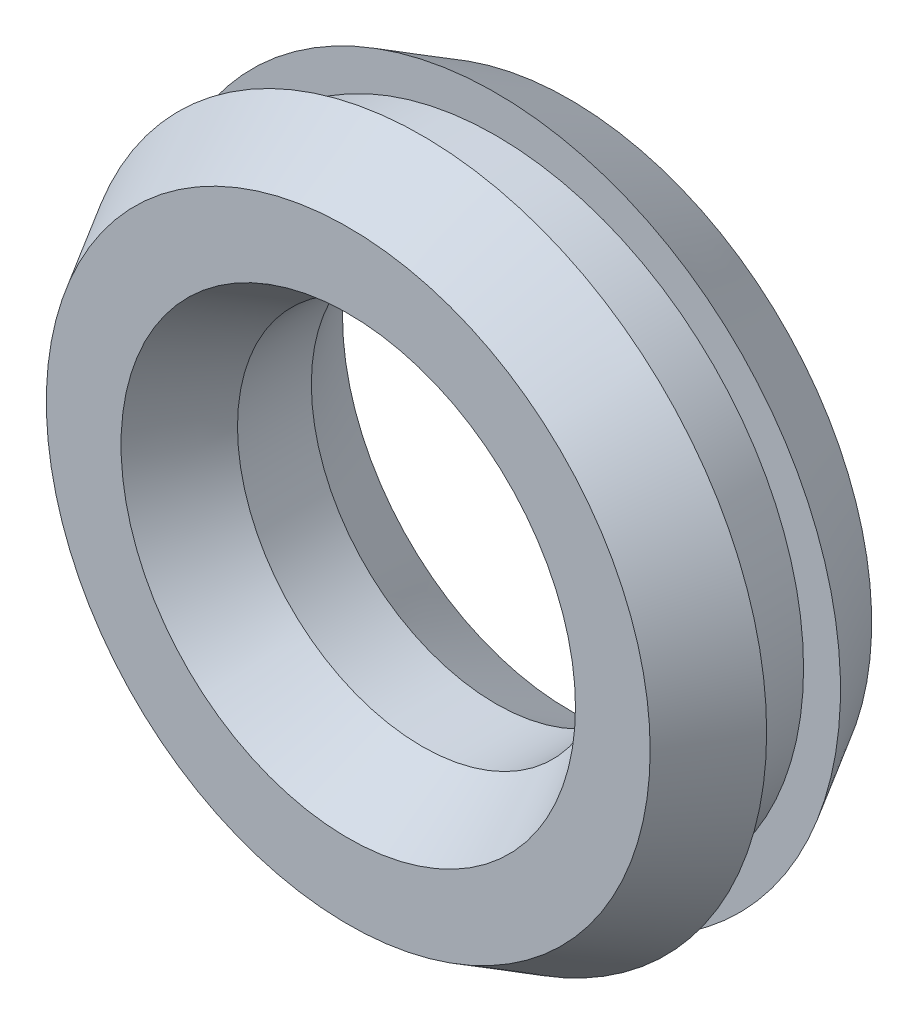
ISO-10303-21;
HEADER;
FILE_DESCRIPTION(('STEP AP214'),'2;1');
FILE_NAME('part.step','',(''),(''),'','','');
FILE_SCHEMA(('AUTOMOTIVE_DESIGN { 1 0 10303 214 1 1 1 1 }'));
ENDSEC;
DATA;
#1=APPLICATION_CONTEXT('core data for automotive mechanical design processes');
#2=APPLICATION_PROTOCOL_DEFINITION('international standard','automotive_design',2000,#1);
#3=PRODUCT_CONTEXT('',#1,'mechanical');
#4=PRODUCT('Part','Part','',(#3));
#5=PRODUCT_RELATED_PRODUCT_CATEGORY('part','',(#4));
#6=PRODUCT_DEFINITION_FORMATION('','',#4);
#7=PRODUCT_DEFINITION_CONTEXT('part definition',#1,'design');
#8=PRODUCT_DEFINITION('design','',#6,#7);
#9=PRODUCT_DEFINITION_SHAPE('','',#8);
#10=(LENGTH_UNIT() NAMED_UNIT(*) SI_UNIT(.MILLI.,.METRE.));
#11=(NAMED_UNIT(*) PLANE_ANGLE_UNIT() SI_UNIT($,.RADIAN.));
#12=(NAMED_UNIT(*) SI_UNIT($,.STERADIAN.) SOLID_ANGLE_UNIT());
#13=UNCERTAINTY_MEASURE_WITH_UNIT(LENGTH_MEASURE(1.E-05),#10,'distance_accuracy_value','');
#14=(GEOMETRIC_REPRESENTATION_CONTEXT(3) GLOBAL_UNCERTAINTY_ASSIGNED_CONTEXT((#13)) GLOBAL_UNIT_ASSIGNED_CONTEXT((#10,
#11,#12)) REPRESENTATION_CONTEXT('',''));
#15=CARTESIAN_POINT('',(0.,0.,0.));
#16=DIRECTION('',(0.,0.,1.));
#17=DIRECTION('',(1.,0.,0.));
#18=AXIS2_PLACEMENT_3D('',#15,#16,#17);
#19=CARTESIAN_POINT('',(0.,0.,3.));
#20=DIRECTION('',(0.,0.,-1.));
#21=DIRECTION('',(-1.,0.,0.));
#22=AXIS2_PLACEMENT_3D('',#19,#20,#21);
#23=CYLINDRICAL_SURFACE('',#22,12.5);
#24=CARTESIAN_POINT('',(0.,0.,3.));
#25=DIRECTION('',(0.,0.,1.));
#26=DIRECTION('',(1.,0.,0.));
#27=AXIS2_PLACEMENT_3D('',#24,#25,#26);
#28=CIRCLE('',#27,12.5);
#29=CARTESIAN_POINT('',(12.5,0.,3.));
#30=VERTEX_POINT('',#29);
#31=EDGE_CURVE('E10',#30,#30,#28,.T.);
#32=ORIENTED_EDGE('',*,*,#31,.F.);
#33=EDGE_LOOP('',(#32));
#34=FACE_BOUND('',#33,.T.);
#35=CARTESIAN_POINT('',(0.,0.,0.));
#36=DIRECTION('',(0.,0.,1.));
#37=DIRECTION('',(1.,0.,0.));
#38=AXIS2_PLACEMENT_3D('',#35,#36,#37);
#39=CIRCLE('',#38,12.5);
#40=CARTESIAN_POINT('',(12.5,0.,0.));
#41=VERTEX_POINT('',#40);
#42=EDGE_CURVE('E39',#41,#41,#39,.T.);
#43=ORIENTED_EDGE('',*,*,#42,.T.);
#44=EDGE_LOOP('',(#43));
#45=FACE_BOUND('',#44,.T.);
#46=ADVANCED_FACE('F36',(#34,#45),#23,.T.);
#47=CARTESIAN_POINT('',(0.,0.,3.));
#48=DIRECTION('',(0.,0.,-1.));
#49=DIRECTION('',(-1.,0.,0.));
#50=AXIS2_PLACEMENT_3D('',#47,#48,#49);
#51=CYLINDRICAL_SURFACE('',#50,7.5);
#52=CARTESIAN_POINT('',(0.,0.,3.));
#53=DIRECTION('',(0.,0.,1.));
#54=DIRECTION('',(1.,0.,0.));
#55=AXIS2_PLACEMENT_3D('',#52,#53,#54);
#56=CIRCLE('',#55,7.5);
#57=CARTESIAN_POINT('',(7.5,0.,3.));
#58=VERTEX_POINT('',#57);
#59=EDGE_CURVE('E57',#58,#58,#56,.T.);
#60=ORIENTED_EDGE('',*,*,#59,.T.);
#61=EDGE_LOOP('',(#60));
#62=FACE_BOUND('',#61,.T.);
#63=CARTESIAN_POINT('',(0.,0.,0.));
#64=DIRECTION('',(0.,0.,1.));
#65=DIRECTION('',(1.,0.,0.));
#66=AXIS2_PLACEMENT_3D('',#63,#64,#65);
#67=CIRCLE('',#66,7.5);
#68=CARTESIAN_POINT('',(7.5,0.,0.));
#69=VERTEX_POINT('',#68);
#70=EDGE_CURVE('E44',#69,#69,#67,.T.);
#71=ORIENTED_EDGE('',*,*,#70,.F.);
#72=EDGE_LOOP('',(#71));
#73=FACE_BOUND('',#72,.T.);
#74=ADVANCED_FACE('F99',(#62,#73),#51,.F.);
#75=CARTESIAN_POINT('',(0.,0.,6.));
#76=DIRECTION('',(0.,0.,1.));
#77=DIRECTION('',(1.,0.,0.));
#78=AXIS2_PLACEMENT_3D('',#75,#76,#77);
#79=PLANE('',#78);
#80=CARTESIAN_POINT('',(0.,0.,6.));
#81=DIRECTION('',(0.,0.,1.));
#82=DIRECTION('',(1.,0.,0.));
#83=AXIS2_PLACEMENT_3D('',#80,#81,#82);
#84=CIRCLE('',#83,12.2679491924311);
#85=CARTESIAN_POINT('',(12.2679491924311,0.,6.));
#86=VERTEX_POINT('',#85);
#87=EDGE_CURVE('E49',#86,#86,#84,.T.);
#88=ORIENTED_EDGE('',*,*,#87,.T.);
#89=EDGE_LOOP('',(#88));
#90=FACE_BOUND('',#89,.T.);
#91=CARTESIAN_POINT('',(0.,0.,6.));
#92=DIRECTION('',(0.,0.,1.));
#93=DIRECTION('',(1.,0.,0.));
#94=AXIS2_PLACEMENT_3D('',#91,#92,#93);
#95=CIRCLE('',#94,9.23205080756888);
#96=CARTESIAN_POINT('',(9.23205080756888,0.,6.));
#97=VERTEX_POINT('',#96);
#98=EDGE_CURVE('E52',#97,#97,#95,.T.);
#99=ORIENTED_EDGE('',*,*,#98,.F.);
#100=EDGE_LOOP('',(#99));
#101=FACE_BOUND('',#100,.T.);
#102=ADVANCED_FACE('F104',(#90,#101),#79,.T.);
#103=CARTESIAN_POINT('',(0.,0.,3.));
#104=DIRECTION('',(0.,0.,1.));
#105=DIRECTION('',(1.,0.,0.));
#106=AXIS2_PLACEMENT_3D('',#103,#104,#105);
#107=PLANE('',#106);
#108=ORIENTED_EDGE('',*,*,#31,.T.);
#109=EDGE_LOOP('',(#108));
#110=FACE_BOUND('',#109,.T.);
#111=CARTESIAN_POINT('',(0.,0.,3.));
#112=DIRECTION('',(0.,0.,1.));
#113=DIRECTION('',(1.,0.,0.));
#114=AXIS2_PLACEMENT_3D('',#111,#112,#113);
#115=CIRCLE('',#114,14.);
#116=CARTESIAN_POINT('',(14.,0.,3.));
#117=VERTEX_POINT('',#116);
#118=EDGE_CURVE('E56',#117,#117,#115,.T.);
#119=ORIENTED_EDGE('',*,*,#118,.F.);
#120=EDGE_LOOP('',(#119));
#121=FACE_BOUND('',#120,.T.);
#122=ADVANCED_FACE('F112',(#110,#121),#107,.F.);
#123=CARTESIAN_POINT('',(0.,0.,3.));
#124=DIRECTION('',(0.,0.,-1.));
#125=DIRECTION('',(1.,0.,0.));
#126=AXIS2_PLACEMENT_3D('',#123,#124,#125);
#127=CONICAL_SURFACE('',#126,14.,0.5235987755983);
#128=ORIENTED_EDGE('',*,*,#87,.F.);
#129=EDGE_LOOP('',(#128));
#130=FACE_BOUND('',#129,.T.);
#131=ORIENTED_EDGE('',*,*,#118,.T.);
#132=EDGE_LOOP('',(#131));
#133=FACE_BOUND('',#132,.T.);
#134=ADVANCED_FACE('F119',(#130,#133),#127,.T.);
#135=CARTESIAN_POINT('',(0.,0.,3.));
#136=DIRECTION('',(0.,0.,1.));
#137=DIRECTION('',(1.,0.,0.));
#138=AXIS2_PLACEMENT_3D('',#135,#136,#137);
#139=CONICAL_SURFACE('',#138,7.5,0.5235987755983);
#140=ORIENTED_EDGE('',*,*,#98,.T.);
#141=EDGE_LOOP('',(#140));
#142=FACE_BOUND('',#141,.T.);
#143=ORIENTED_EDGE('',*,*,#59,.F.);
#144=EDGE_LOOP('',(#143));
#145=FACE_BOUND('',#144,.T.);
#146=ADVANCED_FACE('F94',(#142,#145),#139,.F.);
#147=CARTESIAN_POINT('',(0.,0.,-3.));
#148=DIRECTION('',(0.,0.,-1.));
#149=DIRECTION('',(-1.,0.,0.));
#150=AXIS2_PLACEMENT_3D('',#147,#148,#149);
#151=PLANE('',#150);
#152=CARTESIAN_POINT('',(0.,0.,-3.));
#153=DIRECTION('',(0.,0.,-1.));
#154=DIRECTION('',(-1.,0.,0.));
#155=AXIS2_PLACEMENT_3D('',#152,#153,#154);
#156=CIRCLE('',#155,12.2679491924311);
#157=CARTESIAN_POINT('',(-12.2679491924311,0.,-3.));
#158=VERTEX_POINT('',#157);
#159=EDGE_CURVE('E72',#158,#158,#156,.T.);
#160=ORIENTED_EDGE('',*,*,#159,.T.);
#161=EDGE_LOOP('',(#160));
#162=FACE_BOUND('',#161,.T.);
#163=CARTESIAN_POINT('',(0.,0.,-3.));
#164=DIRECTION('',(0.,0.,-1.));
#165=DIRECTION('',(-1.,0.,0.));
#166=AXIS2_PLACEMENT_3D('',#163,#164,#165);
#167=CIRCLE('',#166,9.23205080756888);
#168=CARTESIAN_POINT('',(-9.23205080756888,0.,-3.));
#169=VERTEX_POINT('',#168);
#170=EDGE_CURVE('E67',#169,#169,#167,.T.);
#171=ORIENTED_EDGE('',*,*,#170,.F.);
#172=EDGE_LOOP('',(#171));
#173=FACE_BOUND('',#172,.T.);
#174=ADVANCED_FACE('F84',(#162,#173),#151,.T.);
#175=CARTESIAN_POINT('',(0.,0.,0.));
#176=DIRECTION('',(0.,0.,-1.));
#177=DIRECTION('',(-1.,0.,0.));
#178=AXIS2_PLACEMENT_3D('',#175,#176,#177);
#179=PLANE('',#178);
#180=ORIENTED_EDGE('',*,*,#42,.F.);
#181=EDGE_LOOP('',(#180));
#182=FACE_BOUND('',#181,.T.);
#183=CARTESIAN_POINT('',(0.,0.,0.));
#184=DIRECTION('',(0.,0.,-1.));
#185=DIRECTION('',(-1.,0.,0.));
#186=AXIS2_PLACEMENT_3D('',#183,#184,#185);
#187=CIRCLE('',#186,14.);
#188=CARTESIAN_POINT('',(-14.,0.,0.));
#189=VERTEX_POINT('',#188);
#190=EDGE_CURVE('E71',#189,#189,#187,.T.);
#191=ORIENTED_EDGE('',*,*,#190,.F.);
#192=EDGE_LOOP('',(#191));
#193=FACE_BOUND('',#192,.T.);
#194=ADVANCED_FACE('F82',(#182,#193),#179,.F.);
#195=CARTESIAN_POINT('',(0.,0.,0.));
#196=DIRECTION('',(0.,0.,1.));
#197=DIRECTION('',(-1.,0.,0.));
#198=AXIS2_PLACEMENT_3D('',#195,#196,#197);
#199=CONICAL_SURFACE('',#198,14.,0.5235987755983);
#200=ORIENTED_EDGE('',*,*,#159,.F.);
#201=EDGE_LOOP('',(#200));
#202=FACE_BOUND('',#201,.T.);
#203=ORIENTED_EDGE('',*,*,#190,.T.);
#204=EDGE_LOOP('',(#203));
#205=FACE_BOUND('',#204,.T.);
#206=ADVANCED_FACE('F80',(#202,#205),#199,.T.);
#207=CARTESIAN_POINT('',(0.,0.,0.));
#208=DIRECTION('',(0.,0.,-1.));
#209=DIRECTION('',(-1.,0.,0.));
#210=AXIS2_PLACEMENT_3D('',#207,#208,#209);
#211=CONICAL_SURFACE('',#210,7.5,0.5235987755983);
#212=ORIENTED_EDGE('',*,*,#170,.T.);
#213=EDGE_LOOP('',(#212));
#214=FACE_BOUND('',#213,.T.);
#215=ORIENTED_EDGE('',*,*,#70,.T.);
#216=EDGE_LOOP('',(#215));
#217=FACE_BOUND('',#216,.T.);
#218=ADVANCED_FACE('F91',(#214,#217),#211,.F.);
#219=CLOSED_SHELL('',(#46,#74,#102,#122,#134,#146,#174,#194,#206,#218));
#220=MANIFOLD_SOLID_BREP('B2',#219);
#221=ADVANCED_BREP_SHAPE_REPRESENTATION('',(#18,#220),#14);
#222=SHAPE_DEFINITION_REPRESENTATION(#9,#221);
ENDSEC;
END-ISO-10303-21;
